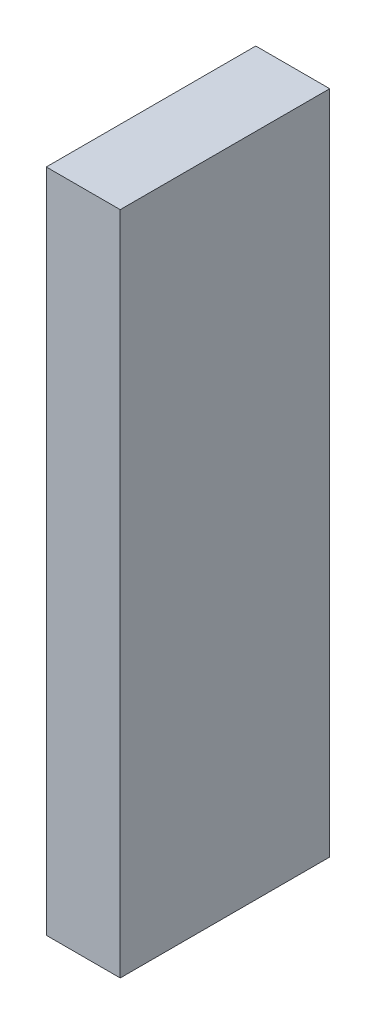
ISO-10303-21;
HEADER;
FILE_DESCRIPTION(('STEP AP214'),'2;1');
FILE_NAME('part.step','',(''),(''),'','','');
FILE_SCHEMA(('AUTOMOTIVE_DESIGN { 1 0 10303 214 1 1 1 1 }'));
ENDSEC;
DATA;
#1=APPLICATION_CONTEXT('core data for automotive mechanical design processes');
#2=APPLICATION_PROTOCOL_DEFINITION('international standard','automotive_design',2000,#1);
#3=PRODUCT_CONTEXT('',#1,'mechanical');
#4=PRODUCT('Part','Part','',(#3));
#5=PRODUCT_RELATED_PRODUCT_CATEGORY('part','',(#4));
#6=PRODUCT_DEFINITION_FORMATION('','',#4);
#7=PRODUCT_DEFINITION_CONTEXT('part definition',#1,'design');
#8=PRODUCT_DEFINITION('design','',#6,#7);
#9=PRODUCT_DEFINITION_SHAPE('','',#8);
#10=(LENGTH_UNIT() NAMED_UNIT(*) SI_UNIT(.MILLI.,.METRE.));
#11=(NAMED_UNIT(*) PLANE_ANGLE_UNIT() SI_UNIT($,.RADIAN.));
#12=(NAMED_UNIT(*) SI_UNIT($,.STERADIAN.) SOLID_ANGLE_UNIT());
#13=UNCERTAINTY_MEASURE_WITH_UNIT(LENGTH_MEASURE(1.E-05),#10,'distance_accuracy_value','');
#14=(GEOMETRIC_REPRESENTATION_CONTEXT(3) GLOBAL_UNCERTAINTY_ASSIGNED_CONTEXT((#13)) GLOBAL_UNIT_ASSIGNED_CONTEXT((#10,
#11,#12)) REPRESENTATION_CONTEXT('',''));
#15=CARTESIAN_POINT('',(0.,0.,0.));
#16=DIRECTION('',(0.,0.,1.));
#17=DIRECTION('',(1.,0.,0.));
#18=AXIS2_PLACEMENT_3D('',#15,#16,#17);
#19=CARTESIAN_POINT('',(-3.04999909061073,2.69998251018302,0.));
#20=DIRECTION('',(-1.,1.19248806385031E-08,0.));
#21=DIRECTION('',(-1.19248806385031E-08,-1.,0.));
#22=AXIS2_PLACEMENT_3D('',#19,#20,#21);
#23=PLANE('',#22);
#24=DIRECTION('',(-1.19248806627069E-08,-1.,0.));
#25=VECTOR('',#24,1.);
#26=CARTESIAN_POINT('',(-3.04999909061073,2.69998251018302,0.));
#27=LINE('',#26,#25);
#28=CARTESIAN_POINT('',(-3.04999909061073,2.69998251018302,0.));
#29=VERTEX_POINT('',#28);
#30=CARTESIAN_POINT('',(-3.04999915500501,-2.70001138630136,0.));
#31=VERTEX_POINT('',#30);
#32=EDGE_CURVE('E11',#29,#31,#27,.T.);
#33=ORIENTED_EDGE('',*,*,#32,.T.);
#34=DIRECTION('',(0.,0.,1.));
#35=VECTOR('',#34,1.);
#36=CARTESIAN_POINT('',(-3.04999915500501,-2.70001138630136,0.));
#37=LINE('',#36,#35);
#38=CARTESIAN_POINT('',(-3.04999915500501,-2.70001138630136,1.6999990940094));
#39=VERTEX_POINT('',#38);
#40=EDGE_CURVE('E88',#31,#39,#37,.T.);
#41=ORIENTED_EDGE('',*,*,#40,.T.);
#42=DIRECTION('',(-1.19248806627069E-08,-1.,0.));
#43=VECTOR('',#42,1.);
#44=CARTESIAN_POINT('',(-3.04999909061073,2.69998251018302,1.6999990940094));
#45=LINE('',#44,#43);
#46=CARTESIAN_POINT('',(-3.04999909061073,2.69998251018302,1.6999990940094));
#47=VERTEX_POINT('',#46);
#48=EDGE_CURVE('E83',#47,#39,#45,.T.);
#49=ORIENTED_EDGE('',*,*,#48,.F.);
#50=DIRECTION('',(0.,0.,1.));
#51=VECTOR('',#50,1.);
#52=CARTESIAN_POINT('',(-3.04999909061073,2.69998251018299,0.));
#53=LINE('',#52,#51);
#54=EDGE_CURVE('E72',#29,#47,#53,.T.);
#55=ORIENTED_EDGE('',*,*,#54,.F.);
#56=EDGE_LOOP('',(#33,#41,#49,#55));
#57=FACE_BOUND('',#56,.T.);
#58=ADVANCED_FACE('F17',(#57),#23,.T.);
#59=CARTESIAN_POINT('',(-3.04999915500501,-2.70001138630136,0.));
#60=DIRECTION('',(-1.19248806385031E-08,-1.,0.));
#61=DIRECTION('',(1.,-1.19248806385031E-08,0.));
#62=AXIS2_PLACEMENT_3D('',#59,#60,#61);
#63=PLANE('',#62);
#64=DIRECTION('',(1.,-1.19248803228865E-08,0.));
#65=VECTOR('',#64,1.);
#66=CARTESIAN_POINT('',(-3.04999915500501,-2.70001138630136,0.));
#67=LINE('',#66,#65);
#68=CARTESIAN_POINT('',(-2.45000068088392,-2.70001139345629,0.));
#69=VERTEX_POINT('',#68);
#70=EDGE_CURVE('E24',#31,#69,#67,.T.);
#71=ORIENTED_EDGE('',*,*,#70,.T.);
#72=DIRECTION('',(0.,0.,1.));
#73=VECTOR('',#72,1.);
#74=CARTESIAN_POINT('',(-2.45000068088392,-2.70001139345627,0.));
#75=LINE('',#74,#73);
#76=CARTESIAN_POINT('',(-2.45000068088392,-2.70001139345629,1.6999990940094));
#77=VERTEX_POINT('',#76);
#78=EDGE_CURVE('E85',#69,#77,#75,.T.);
#79=ORIENTED_EDGE('',*,*,#78,.T.);
#80=DIRECTION('',(1.,-1.19248803228865E-08,0.));
#81=VECTOR('',#80,1.);
#82=CARTESIAN_POINT('',(-3.04999915500501,-2.70001138630136,1.6999990940094));
#83=LINE('',#82,#81);
#84=EDGE_CURVE('E66',#39,#77,#83,.T.);
#85=ORIENTED_EDGE('',*,*,#84,.F.);
#86=ORIENTED_EDGE('',*,*,#40,.F.);
#87=EDGE_LOOP('',(#71,#79,#85,#86));
#88=FACE_BOUND('',#87,.T.);
#89=ADVANCED_FACE('F89',(#88),#63,.T.);
#90=CARTESIAN_POINT('',(-2.45000068088392,-2.70001139345629,0.));
#91=DIRECTION('',(1.,-1.19248806385031E-08,0.));
#92=DIRECTION('',(1.19248806385031E-08,1.,0.));
#93=AXIS2_PLACEMENT_3D('',#90,#91,#92);
#94=PLANE('',#93);
#95=DIRECTION('',(1.19248806627069E-08,1.,0.));
#96=VECTOR('',#95,1.);
#97=CARTESIAN_POINT('',(-2.45000068088392,-2.70001139345629,0.));
#98=LINE('',#97,#96);
#99=CARTESIAN_POINT('',(-2.45000061648963,2.69998250302808,0.));
#100=VERTEX_POINT('',#99);
#101=EDGE_CURVE('E62',#69,#100,#98,.T.);
#102=ORIENTED_EDGE('',*,*,#101,.T.);
#103=DIRECTION('',(0.,0.,1.));
#104=VECTOR('',#103,1.);
#105=CARTESIAN_POINT('',(-2.45000061648963,2.69998250302808,0.));
#106=LINE('',#105,#104);
#107=CARTESIAN_POINT('',(-2.45000061648963,2.69998250302808,1.6999990940094));
#108=VERTEX_POINT('',#107);
#109=EDGE_CURVE('E55',#100,#108,#106,.T.);
#110=ORIENTED_EDGE('',*,*,#109,.T.);
#111=DIRECTION('',(1.19248806627069E-08,1.,0.));
#112=VECTOR('',#111,1.);
#113=CARTESIAN_POINT('',(-2.45000068088392,-2.70001139345629,1.6999990940094));
#114=LINE('',#113,#112);
#115=EDGE_CURVE('E59',#77,#108,#114,.T.);
#116=ORIENTED_EDGE('',*,*,#115,.F.);
#117=ORIENTED_EDGE('',*,*,#78,.F.);
#118=EDGE_LOOP('',(#102,#110,#116,#117));
#119=FACE_BOUND('',#118,.T.);
#120=ADVANCED_FACE('F57',(#119),#94,.T.);
#121=CARTESIAN_POINT('',(-2.45000061648963,2.69998250302808,0.));
#122=DIRECTION('',(1.19248806385031E-08,1.,0.));
#123=DIRECTION('',(-1.,1.19248806385031E-08,0.));
#124=AXIS2_PLACEMENT_3D('',#121,#122,#123);
#125=PLANE('',#124);
#126=DIRECTION('',(-1.,1.19248803228865E-08,0.));
#127=VECTOR('',#126,1.);
#128=CARTESIAN_POINT('',(-2.45000061648963,2.69998250302808,0.));
#129=LINE('',#128,#127);
#130=EDGE_CURVE('E65',#100,#29,#129,.T.);
#131=ORIENTED_EDGE('',*,*,#130,.T.);
#132=ORIENTED_EDGE('',*,*,#54,.T.);
#133=DIRECTION('',(-1.,1.19248803228865E-08,0.));
#134=VECTOR('',#133,1.);
#135=CARTESIAN_POINT('',(-2.45000061648963,2.69998250302808,1.6999990940094));
#136=LINE('',#135,#134);
#137=EDGE_CURVE('E70',#108,#47,#136,.T.);
#138=ORIENTED_EDGE('',*,*,#137,.F.);
#139=ORIENTED_EDGE('',*,*,#109,.F.);
#140=EDGE_LOOP('',(#131,#132,#138,#139));
#141=FACE_BOUND('',#140,.T.);
#142=ADVANCED_FACE('F71',(#141),#125,.T.);
#143=CARTESIAN_POINT('',(65.7749938964844,-329.475006103516,1.6999990940094));
#144=DIRECTION('',(0.,0.,1.));
#145=DIRECTION('',(1.19248806385031E-08,1.,0.));
#146=AXIS2_PLACEMENT_3D('',#143,#144,#145);
#147=PLANE('',#146);
#148=ORIENTED_EDGE('',*,*,#48,.T.);
#149=ORIENTED_EDGE('',*,*,#84,.T.);
#150=ORIENTED_EDGE('',*,*,#115,.T.);
#151=ORIENTED_EDGE('',*,*,#137,.T.);
#152=EDGE_LOOP('',(#148,#149,#150,#151));
#153=FACE_BOUND('',#152,.T.);
#154=ADVANCED_FACE('F76',(#153),#147,.T.);
#155=CARTESIAN_POINT('',(65.7749938964844,-329.475006103516,0.));
#156=DIRECTION('',(0.,0.,1.));
#157=DIRECTION('',(1.19248806385031E-08,1.,0.));
#158=AXIS2_PLACEMENT_3D('',#155,#156,#157);
#159=PLANE('',#158);
#160=ORIENTED_EDGE('',*,*,#130,.F.);
#161=ORIENTED_EDGE('',*,*,#101,.F.);
#162=ORIENTED_EDGE('',*,*,#70,.F.);
#163=ORIENTED_EDGE('',*,*,#32,.F.);
#164=EDGE_LOOP('',(#160,#161,#162,#163));
#165=FACE_BOUND('',#164,.T.);
#166=ADVANCED_FACE('F91',(#165),#159,.F.);
#167=CLOSED_SHELL('',(#58,#89,#120,#142,#154,#166));
#168=MANIFOLD_SOLID_BREP('B1',#167);
#169=ADVANCED_BREP_SHAPE_REPRESENTATION('',(#18,#168),#14);
#170=SHAPE_DEFINITION_REPRESENTATION(#9,#169);
ENDSEC;
END-ISO-10303-21;
